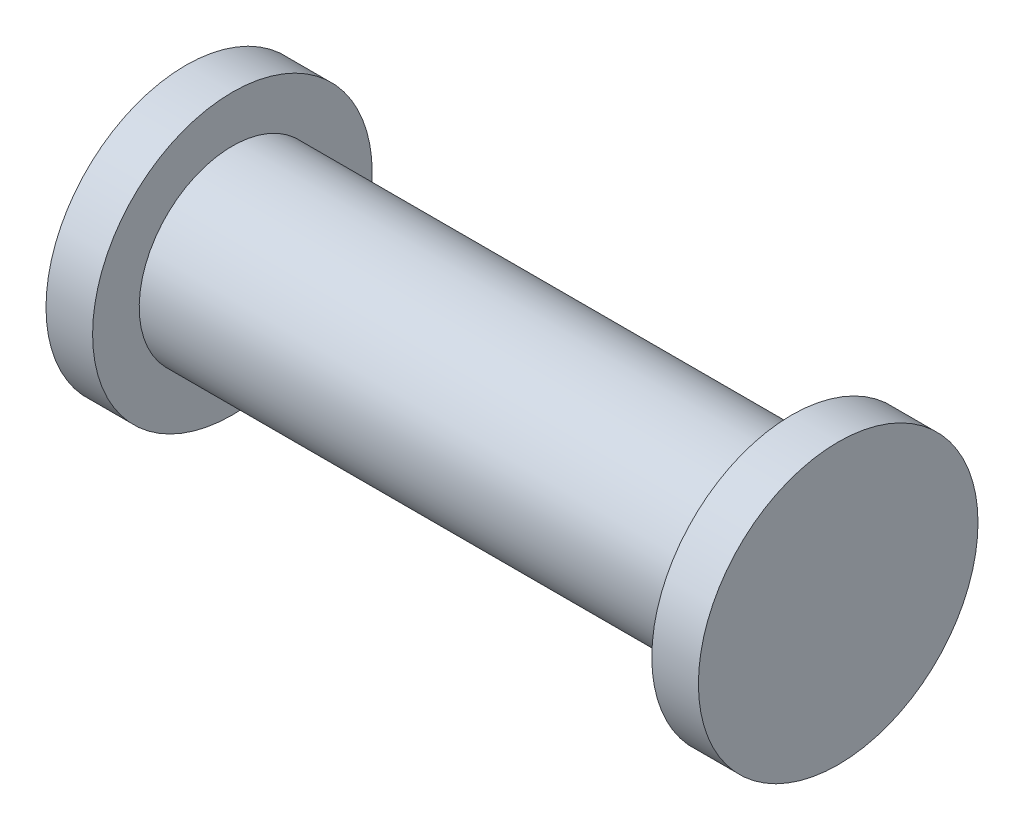
ISO-10303-21;
HEADER;
FILE_DESCRIPTION(('STEP AP214'),'2;1');
FILE_NAME('part.step','',(''),(''),'','','');
FILE_SCHEMA(('AUTOMOTIVE_DESIGN { 1 0 10303 214 1 1 1 1 }'));
ENDSEC;
DATA;
#1=APPLICATION_CONTEXT('core data for automotive mechanical design processes');
#2=APPLICATION_PROTOCOL_DEFINITION('international standard','automotive_design',2000,#1);
#3=PRODUCT_CONTEXT('',#1,'mechanical');
#4=PRODUCT('Part','Part','',(#3));
#5=PRODUCT_RELATED_PRODUCT_CATEGORY('part','',(#4));
#6=PRODUCT_DEFINITION_FORMATION('','',#4);
#7=PRODUCT_DEFINITION_CONTEXT('part definition',#1,'design');
#8=PRODUCT_DEFINITION('design','',#6,#7);
#9=PRODUCT_DEFINITION_SHAPE('','',#8);
#10=(LENGTH_UNIT() NAMED_UNIT(*) SI_UNIT(.MILLI.,.METRE.));
#11=(NAMED_UNIT(*) PLANE_ANGLE_UNIT() SI_UNIT($,.RADIAN.));
#12=(NAMED_UNIT(*) SI_UNIT($,.STERADIAN.) SOLID_ANGLE_UNIT());
#13=UNCERTAINTY_MEASURE_WITH_UNIT(LENGTH_MEASURE(1.E-05),#10,'distance_accuracy_value','');
#14=(GEOMETRIC_REPRESENTATION_CONTEXT(3) GLOBAL_UNCERTAINTY_ASSIGNED_CONTEXT((#13)) GLOBAL_UNIT_ASSIGNED_CONTEXT((#10,
#11,#12)) REPRESENTATION_CONTEXT('',''));
#15=CARTESIAN_POINT('',(0.,0.,0.));
#16=DIRECTION('',(0.,0.,1.));
#17=DIRECTION('',(1.,0.,0.));
#18=AXIS2_PLACEMENT_3D('',#15,#16,#17);
#19=CARTESIAN_POINT('',(0.,0.,0.));
#20=DIRECTION('',(1.,0.,0.));
#21=DIRECTION('',(0.,1.,0.));
#22=AXIS2_PLACEMENT_3D('',#19,#20,#21);
#23=PLANE('',#22);
#24=CARTESIAN_POINT('',(0.,0.,0.));
#25=DIRECTION('',(-1.,0.,0.));
#26=DIRECTION('',(0.,-1.,0.));
#27=AXIS2_PLACEMENT_3D('',#24,#25,#26);
#28=CIRCLE('',#27,1.50000000000001);
#29=CARTESIAN_POINT('',(0.,-1.50000000000002,0.));
#30=VERTEX_POINT('',#29);
#31=EDGE_CURVE('E10',#30,#30,#28,.T.);
#32=ORIENTED_EDGE('',*,*,#31,.T.);
#33=EDGE_LOOP('',(#32));
#34=FACE_BOUND('',#33,.T.);
#35=ADVANCED_FACE('F34',(#34),#23,.F.);
#36=CARTESIAN_POINT('',(6.5,0.,0.));
#37=DIRECTION('',(-1.,0.,0.));
#38=DIRECTION('',(0.,-1.,0.));
#39=AXIS2_PLACEMENT_3D('',#36,#37,#38);
#40=CYLINDRICAL_SURFACE('',#39,1.50000000000001);
#41=ORIENTED_EDGE('',*,*,#31,.F.);
#42=EDGE_LOOP('',(#41));
#43=FACE_BOUND('',#42,.T.);
#44=CARTESIAN_POINT('',(0.500000000000003,0.,0.));
#45=DIRECTION('',(-1.,0.,0.));
#46=DIRECTION('',(0.,-1.,0.));
#47=AXIS2_PLACEMENT_3D('',#44,#45,#46);
#48=CIRCLE('',#47,1.50000000000001);
#49=CARTESIAN_POINT('',(0.500000000000005,-1.50000000000002,0.));
#50=VERTEX_POINT('',#49);
#51=EDGE_CURVE('E41',#50,#50,#48,.T.);
#52=ORIENTED_EDGE('',*,*,#51,.T.);
#53=EDGE_LOOP('',(#52));
#54=FACE_BOUND('',#53,.T.);
#55=ADVANCED_FACE('F78',(#43,#54),#40,.T.);
#56=CARTESIAN_POINT('',(0.5,1.5,0.));
#57=DIRECTION('',(-1.,0.,0.));
#58=DIRECTION('',(0.,-1.,0.));
#59=AXIS2_PLACEMENT_3D('',#56,#57,#58);
#60=PLANE('',#59);
#61=ORIENTED_EDGE('',*,*,#51,.F.);
#62=EDGE_LOOP('',(#61));
#63=FACE_BOUND('',#62,.T.);
#64=CARTESIAN_POINT('',(0.500000000000002,0.,0.));
#65=DIRECTION('',(-1.,0.,0.));
#66=DIRECTION('',(0.,-1.,0.));
#67=AXIS2_PLACEMENT_3D('',#64,#65,#66);
#68=CIRCLE('',#67,1.00000000000001);
#69=CARTESIAN_POINT('',(0.500000000000004,-1.00000000000002,0.));
#70=VERTEX_POINT('',#69);
#71=EDGE_CURVE('E47',#70,#70,#68,.T.);
#72=ORIENTED_EDGE('',*,*,#71,.T.);
#73=EDGE_LOOP('',(#72));
#74=FACE_BOUND('',#73,.T.);
#75=ADVANCED_FACE('F82',(#63,#74),#60,.F.);
#76=CARTESIAN_POINT('',(6.5,0.,0.));
#77=DIRECTION('',(-1.,0.,0.));
#78=DIRECTION('',(0.,-1.,0.));
#79=AXIS2_PLACEMENT_3D('',#76,#77,#78);
#80=CYLINDRICAL_SURFACE('',#79,1.);
#81=ORIENTED_EDGE('',*,*,#71,.F.);
#82=EDGE_LOOP('',(#81));
#83=FACE_BOUND('',#82,.T.);
#84=CARTESIAN_POINT('',(6.5,0.,0.));
#85=DIRECTION('',(-1.,0.,0.));
#86=DIRECTION('',(0.,-1.,0.));
#87=AXIS2_PLACEMENT_3D('',#84,#85,#86);
#88=CIRCLE('',#87,1.);
#89=CARTESIAN_POINT('',(6.5,-1.,0.));
#90=VERTEX_POINT('',#89);
#91=EDGE_CURVE('E52',#90,#90,#88,.T.);
#92=ORIENTED_EDGE('',*,*,#91,.T.);
#93=EDGE_LOOP('',(#92));
#94=FACE_BOUND('',#93,.T.);
#95=ADVANCED_FACE('F87',(#83,#94),#80,.T.);
#96=CARTESIAN_POINT('',(6.5,1.,0.));
#97=DIRECTION('',(1.,0.,0.));
#98=DIRECTION('',(0.,1.,0.));
#99=AXIS2_PLACEMENT_3D('',#96,#97,#98);
#100=PLANE('',#99);
#101=ORIENTED_EDGE('',*,*,#91,.F.);
#102=EDGE_LOOP('',(#101));
#103=FACE_BOUND('',#102,.T.);
#104=CARTESIAN_POINT('',(6.5,0.,0.));
#105=DIRECTION('',(-1.,0.,0.));
#106=DIRECTION('',(0.,-1.,0.));
#107=AXIS2_PLACEMENT_3D('',#104,#105,#106);
#108=CIRCLE('',#107,1.5);
#109=CARTESIAN_POINT('',(6.50000000000001,-1.5,0.));
#110=VERTEX_POINT('',#109);
#111=EDGE_CURVE('E58',#110,#110,#108,.T.);
#112=ORIENTED_EDGE('',*,*,#111,.T.);
#113=EDGE_LOOP('',(#112));
#114=FACE_BOUND('',#113,.T.);
#115=ADVANCED_FACE('F74',(#103,#114),#100,.F.);
#116=CARTESIAN_POINT('',(6.5,0.,0.));
#117=DIRECTION('',(-1.,0.,0.));
#118=DIRECTION('',(0.,-1.,0.));
#119=AXIS2_PLACEMENT_3D('',#116,#117,#118);
#120=CYLINDRICAL_SURFACE('',#119,1.5);
#121=ORIENTED_EDGE('',*,*,#111,.F.);
#122=EDGE_LOOP('',(#121));
#123=FACE_BOUND('',#122,.T.);
#124=CARTESIAN_POINT('',(7.,0.,0.));
#125=DIRECTION('',(-1.,0.,0.));
#126=DIRECTION('',(0.,-1.,0.));
#127=AXIS2_PLACEMENT_3D('',#124,#125,#126);
#128=CIRCLE('',#127,1.5);
#129=CARTESIAN_POINT('',(7.00000000000001,-1.5,0.));
#130=VERTEX_POINT('',#129);
#131=EDGE_CURVE('E61',#130,#130,#128,.T.);
#132=ORIENTED_EDGE('',*,*,#131,.T.);
#133=EDGE_LOOP('',(#132));
#134=FACE_BOUND('',#133,.T.);
#135=ADVANCED_FACE('F66',(#123,#134),#120,.T.);
#136=CARTESIAN_POINT('',(7.,1.5,0.));
#137=DIRECTION('',(-1.,0.,0.));
#138=DIRECTION('',(0.,-1.,0.));
#139=AXIS2_PLACEMENT_3D('',#136,#137,#138);
#140=PLANE('',#139);
#141=ORIENTED_EDGE('',*,*,#131,.F.);
#142=EDGE_LOOP('',(#141));
#143=FACE_BOUND('',#142,.T.);
#144=ADVANCED_FACE('F68',(#143),#140,.F.);
#145=CLOSED_SHELL('',(#35,#55,#75,#95,#115,#135,#144));
#146=MANIFOLD_SOLID_BREP('B2',#145);
#147=ADVANCED_BREP_SHAPE_REPRESENTATION('',(#18,#146),#14);
#148=SHAPE_DEFINITION_REPRESENTATION(#9,#147);
ENDSEC;
END-ISO-10303-21;
